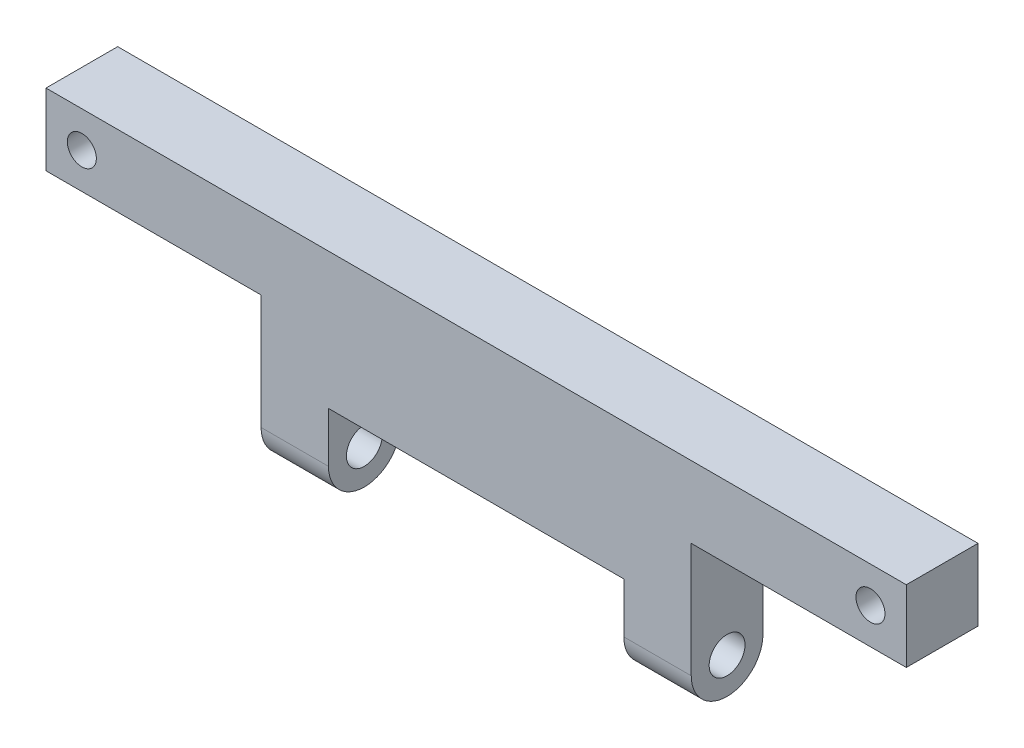
ISO-10303-21;
HEADER;
FILE_DESCRIPTION(('STEP AP214'),'2;1');
FILE_NAME('part.step','',(''),(''),'','','');
FILE_SCHEMA(('AUTOMOTIVE_DESIGN { 1 0 10303 214 1 1 1 1 }'));
ENDSEC;
DATA;
#1=APPLICATION_CONTEXT('core data for automotive mechanical design processes');
#2=APPLICATION_PROTOCOL_DEFINITION('international standard','automotive_design',2000,#1);
#3=PRODUCT_CONTEXT('',#1,'mechanical');
#4=PRODUCT('Part','Part','',(#3));
#5=PRODUCT_RELATED_PRODUCT_CATEGORY('part','',(#4));
#6=PRODUCT_DEFINITION_FORMATION('','',#4);
#7=PRODUCT_DEFINITION_CONTEXT('part definition',#1,'design');
#8=PRODUCT_DEFINITION('design','',#6,#7);
#9=PRODUCT_DEFINITION_SHAPE('','',#8);
#10=(LENGTH_UNIT() NAMED_UNIT(*) SI_UNIT(.MILLI.,.METRE.));
#11=(NAMED_UNIT(*) PLANE_ANGLE_UNIT() SI_UNIT($,.RADIAN.));
#12=(NAMED_UNIT(*) SI_UNIT($,.STERADIAN.) SOLID_ANGLE_UNIT());
#13=UNCERTAINTY_MEASURE_WITH_UNIT(LENGTH_MEASURE(1.E-05),#10,'distance_accuracy_value','');
#14=(GEOMETRIC_REPRESENTATION_CONTEXT(3) GLOBAL_UNCERTAINTY_ASSIGNED_CONTEXT((#13)) GLOBAL_UNIT_ASSIGNED_CONTEXT((#10,
#11,#12)) REPRESENTATION_CONTEXT('',''));
#15=CARTESIAN_POINT('',(0.,0.,0.));
#16=DIRECTION('',(0.,0.,1.));
#17=DIRECTION('',(1.,0.,0.));
#18=AXIS2_PLACEMENT_3D('',#15,#16,#17);
#19=CARTESIAN_POINT('',(-7.07106781186548,60.,2.5));
#20=DIRECTION('',(1.,0.,0.));
#21=DIRECTION('',(0.,0.,-1.));
#22=AXIS2_PLACEMENT_3D('',#19,#20,#21);
#23=CYLINDRICAL_SURFACE('',#22,1.25);
#24=CARTESIAN_POINT('',(0.,60.,2.5));
#25=DIRECTION('',(-1.,0.,0.));
#26=DIRECTION('',(0.,0.,1.));
#27=AXIS2_PLACEMENT_3D('',#24,#25,#26);
#28=CIRCLE('',#27,1.25);
#29=CARTESIAN_POINT('',(0.,60.,3.75));
#30=VERTEX_POINT('',#29);
#31=EDGE_CURVE('E171',#30,#30,#28,.F.);
#32=ORIENTED_EDGE('',*,*,#31,.T.);
#33=EDGE_LOOP('',(#32));
#34=FACE_BOUND('',#33,.T.);
#35=CARTESIAN_POINT('',(-4.7,60.,2.5));
#36=DIRECTION('',(1.,0.,0.));
#37=DIRECTION('',(0.,1.,0.));
#38=AXIS2_PLACEMENT_3D('',#35,#36,#37);
#39=CIRCLE('',#38,1.25);
#40=CARTESIAN_POINT('',(-4.7,61.25,2.5));
#41=VERTEX_POINT('',#40);
#42=EDGE_CURVE('E201',#41,#41,#39,.F.);
#43=ORIENTED_EDGE('',*,*,#42,.T.);
#44=EDGE_LOOP('',(#43));
#45=FACE_BOUND('',#44,.T.);
#46=ADVANCED_FACE('F33',(#34,#45),#23,.F.);
#47=CARTESIAN_POINT('',(-30.,60.,2.5));
#48=DIRECTION('',(1.,0.,0.));
#49=DIRECTION('',(0.,0.,-1.));
#50=AXIS2_PLACEMENT_3D('',#47,#48,#49);
#51=CYLINDRICAL_SURFACE('',#50,2.5);
#52=DIRECTION('',(1.,0.,0.));
#53=VECTOR('',#52,1.);
#54=CARTESIAN_POINT('',(-30.,60.,5.));
#55=LINE('',#54,#53);
#56=CARTESIAN_POINT('',(-4.7,60.,5.));
#57=VERTEX_POINT('',#56);
#58=CARTESIAN_POINT('',(0.,60.,5.));
#59=VERTEX_POINT('',#58);
#60=EDGE_CURVE('E222',#57,#59,#55,.T.);
#61=ORIENTED_EDGE('',*,*,#60,.F.);
#62=CARTESIAN_POINT('',(-4.7,60.,2.5));
#63=DIRECTION('',(1.,0.,0.));
#64=DIRECTION('',(0.,1.,0.));
#65=AXIS2_PLACEMENT_3D('',#62,#63,#64);
#66=CIRCLE('',#65,2.5);
#67=CARTESIAN_POINT('',(-4.7,60.,0.));
#68=VERTEX_POINT('',#67);
#69=EDGE_CURVE('E198',#57,#68,#66,.T.);
#70=ORIENTED_EDGE('',*,*,#69,.T.);
#71=DIRECTION('',(1.,0.,0.));
#72=VECTOR('',#71,1.);
#73=CARTESIAN_POINT('',(-30.,60.,0.));
#74=LINE('',#73,#72);
#75=CARTESIAN_POINT('',(0.,60.,0.));
#76=VERTEX_POINT('',#75);
#77=EDGE_CURVE('E214',#68,#76,#74,.T.);
#78=ORIENTED_EDGE('',*,*,#77,.T.);
#79=CARTESIAN_POINT('',(0.,60.,2.5));
#80=DIRECTION('',(-1.,0.,0.));
#81=DIRECTION('',(0.,0.,1.));
#82=AXIS2_PLACEMENT_3D('',#79,#80,#81);
#83=CIRCLE('',#82,2.5);
#84=EDGE_CURVE('E207',#76,#59,#83,.T.);
#85=ORIENTED_EDGE('',*,*,#84,.T.);
#86=EDGE_LOOP('',(#61,#70,#78,#85));
#87=FACE_BOUND('',#86,.T.);
#88=ADVANCED_FACE('F233',(#87),#51,.T.);
#89=CARTESIAN_POINT('',(-25.3,60.,2.5));
#90=DIRECTION('',(-1.,0.,0.));
#91=DIRECTION('',(0.,-1.,0.));
#92=AXIS2_PLACEMENT_3D('',#89,#90,#91);
#93=CIRCLE('',#92,1.25);
#94=CARTESIAN_POINT('',(-25.3,58.75,2.5));
#95=VERTEX_POINT('',#94);
#96=EDGE_CURVE('E189',#95,#95,#93,.F.);
#97=ORIENTED_EDGE('',*,*,#96,.T.);
#98=EDGE_LOOP('',(#97));
#99=FACE_BOUND('',#98,.T.);
#100=CARTESIAN_POINT('',(-30.,60.,2.5));
#101=DIRECTION('',(-1.,0.,0.));
#102=DIRECTION('',(0.,0.,1.));
#103=AXIS2_PLACEMENT_3D('',#100,#101,#102);
#104=CIRCLE('',#103,1.25);
#105=CARTESIAN_POINT('',(-30.,60.,3.75));
#106=VERTEX_POINT('',#105);
#107=EDGE_CURVE('E204',#106,#106,#104,.T.);
#108=ORIENTED_EDGE('',*,*,#107,.T.);
#109=EDGE_LOOP('',(#108));
#110=FACE_BOUND('',#109,.T.);
#111=ADVANCED_FACE('F35',(#99,#110),#23,.F.);
#112=CARTESIAN_POINT('',(0.,60.,2.5));
#113=DIRECTION('',(-1.,0.,0.));
#114=DIRECTION('',(0.,0.,1.));
#115=AXIS2_PLACEMENT_3D('',#112,#113,#114);
#116=PLANE('',#115);
#117=DIRECTION('',(0.,-1.,0.));
#118=VECTOR('',#117,1.);
#119=CARTESIAN_POINT('',(0.,60.,0.));
#120=LINE('',#119,#118);
#121=CARTESIAN_POINT('',(0.,68.,0.));
#122=VERTEX_POINT('',#121);
#123=EDGE_CURVE('E210',#122,#76,#120,.T.);
#124=ORIENTED_EDGE('',*,*,#123,.F.);
#125=DIRECTION('',(0.,0.,1.));
#126=VECTOR('',#125,1.);
#127=CARTESIAN_POINT('',(0.,68.,2.5));
#128=LINE('',#127,#126);
#129=CARTESIAN_POINT('',(0.,68.,5.));
#130=VERTEX_POINT('',#129);
#131=EDGE_CURVE('E56',#122,#130,#128,.T.);
#132=ORIENTED_EDGE('',*,*,#131,.T.);
#133=DIRECTION('',(0.,1.,0.));
#134=VECTOR('',#133,1.);
#135=CARTESIAN_POINT('',(0.,60.,5.));
#136=LINE('',#135,#134);
#137=EDGE_CURVE('E217',#59,#130,#136,.T.);
#138=ORIENTED_EDGE('',*,*,#137,.F.);
#139=ORIENTED_EDGE('',*,*,#84,.F.);
#140=EDGE_LOOP('',(#124,#132,#138,#139));
#141=FACE_BOUND('',#140,.T.);
#142=ORIENTED_EDGE('',*,*,#31,.F.);
#143=EDGE_LOOP('',(#142));
#144=FACE_BOUND('',#143,.T.);
#145=ADVANCED_FACE('F230',(#141,#144),#116,.F.);
#146=CARTESIAN_POINT('',(-30.,60.,2.5));
#147=DIRECTION('',(-1.,0.,0.));
#148=DIRECTION('',(0.,0.,1.));
#149=AXIS2_PLACEMENT_3D('',#146,#147,#148);
#150=PLANE('',#149);
#151=DIRECTION('',(0.,0.,1.));
#152=VECTOR('',#151,1.);
#153=CARTESIAN_POINT('',(-30.,68.,2.5));
#154=LINE('',#153,#152);
#155=CARTESIAN_POINT('',(-30.,68.,0.));
#156=VERTEX_POINT('',#155);
#157=CARTESIAN_POINT('',(-30.,68.,5.));
#158=VERTEX_POINT('',#157);
#159=EDGE_CURVE('E167',#156,#158,#154,.T.);
#160=ORIENTED_EDGE('',*,*,#159,.F.);
#161=DIRECTION('',(0.,-1.,0.));
#162=VECTOR('',#161,1.);
#163=CARTESIAN_POINT('',(-30.,60.,0.));
#164=LINE('',#163,#162);
#165=CARTESIAN_POINT('',(-30.,60.,0.));
#166=VERTEX_POINT('',#165);
#167=EDGE_CURVE('E212',#156,#166,#164,.T.);
#168=ORIENTED_EDGE('',*,*,#167,.T.);
#169=CARTESIAN_POINT('',(-30.,60.,2.5));
#170=DIRECTION('',(-1.,0.,0.));
#171=DIRECTION('',(0.,0.,1.));
#172=AXIS2_PLACEMENT_3D('',#169,#170,#171);
#173=CIRCLE('',#172,2.5);
#174=CARTESIAN_POINT('',(-30.,60.,5.));
#175=VERTEX_POINT('',#174);
#176=EDGE_CURVE('E208',#166,#175,#173,.T.);
#177=ORIENTED_EDGE('',*,*,#176,.T.);
#178=DIRECTION('',(0.,1.,0.));
#179=VECTOR('',#178,1.);
#180=CARTESIAN_POINT('',(-30.,60.,5.));
#181=LINE('',#180,#179);
#182=EDGE_CURVE('E48',#175,#158,#181,.T.);
#183=ORIENTED_EDGE('',*,*,#182,.T.);
#184=EDGE_LOOP('',(#160,#168,#177,#183));
#185=FACE_BOUND('',#184,.T.);
#186=ORIENTED_EDGE('',*,*,#107,.F.);
#187=EDGE_LOOP('',(#186));
#188=FACE_BOUND('',#187,.T.);
#189=ADVANCED_FACE('F253',(#185,#188),#150,.T.);
#190=CARTESIAN_POINT('',(-25.3,60.,0.));
#191=VERTEX_POINT('',#190);
#192=EDGE_CURVE('E220',#166,#191,#74,.T.);
#193=ORIENTED_EDGE('',*,*,#192,.T.);
#194=CARTESIAN_POINT('',(-25.3,60.,2.5));
#195=DIRECTION('',(-1.,0.,0.));
#196=DIRECTION('',(0.,-1.,0.));
#197=AXIS2_PLACEMENT_3D('',#194,#195,#196);
#198=CIRCLE('',#197,2.5);
#199=CARTESIAN_POINT('',(-25.3,60.,5.));
#200=VERTEX_POINT('',#199);
#201=EDGE_CURVE('E186',#191,#200,#198,.T.);
#202=ORIENTED_EDGE('',*,*,#201,.T.);
#203=EDGE_CURVE('E41',#175,#200,#55,.T.);
#204=ORIENTED_EDGE('',*,*,#203,.F.);
#205=ORIENTED_EDGE('',*,*,#176,.F.);
#206=EDGE_LOOP('',(#193,#202,#204,#205));
#207=FACE_BOUND('',#206,.T.);
#208=ADVANCED_FACE('F252',(#207),#51,.T.);
#209=CARTESIAN_POINT('',(-30.,60.,5.));
#210=DIRECTION('',(0.,0.,-1.));
#211=DIRECTION('',(-1.,0.,0.));
#212=AXIS2_PLACEMENT_3D('',#209,#210,#211);
#213=PLANE('',#212);
#214=CARTESIAN_POINT('',(-42.5,70.5,5.));
#215=DIRECTION('',(0.,0.,-1.));
#216=DIRECTION('',(-1.,0.,0.));
#217=AXIS2_PLACEMENT_3D('',#214,#215,#216);
#218=CIRCLE('',#217,1.01231442212876);
#219=CARTESIAN_POINT('',(-42.5,71.5123144221287,5.));
#220=VERTEX_POINT('',#219);
#221=EDGE_CURVE('E273',#220,#220,#218,.F.);
#222=ORIENTED_EDGE('',*,*,#221,.F.);
#223=EDGE_LOOP('',(#222));
#224=FACE_BOUND('',#223,.T.);
#225=CARTESIAN_POINT('',(12.5,70.5,5.));
#226=DIRECTION('',(0.,0.,-1.));
#227=DIRECTION('',(-1.,0.,0.));
#228=AXIS2_PLACEMENT_3D('',#225,#226,#227);
#229=CIRCLE('',#228,1.01231442212876);
#230=CARTESIAN_POINT('',(12.5,71.5123144221287,5.));
#231=VERTEX_POINT('',#230);
#232=EDGE_CURVE('E147',#231,#231,#229,.T.);
#233=ORIENTED_EDGE('',*,*,#232,.T.);
#234=EDGE_LOOP('',(#233));
#235=FACE_BOUND('',#234,.T.);
#236=ORIENTED_EDGE('',*,*,#137,.T.);
#237=DIRECTION('',(1.,0.,0.));
#238=VECTOR('',#237,1.);
#239=CARTESIAN_POINT('',(15.,68.,5.));
#240=LINE('',#239,#238);
#241=CARTESIAN_POINT('',(15.,68.,5.));
#242=VERTEX_POINT('',#241);
#243=EDGE_CURVE('E168',#130,#242,#240,.T.);
#244=ORIENTED_EDGE('',*,*,#243,.T.);
#245=DIRECTION('',(0.,1.,0.));
#246=VECTOR('',#245,1.);
#247=CARTESIAN_POINT('',(15.,73.,5.));
#248=LINE('',#247,#246);
#249=CARTESIAN_POINT('',(15.,73.,5.));
#250=VERTEX_POINT('',#249);
#251=EDGE_CURVE('E131',#242,#250,#248,.T.);
#252=ORIENTED_EDGE('',*,*,#251,.T.);
#253=DIRECTION('',(-1.,0.,0.));
#254=VECTOR('',#253,1.);
#255=CARTESIAN_POINT('',(15.,73.,5.));
#256=LINE('',#255,#254);
#257=CARTESIAN_POINT('',(-45.,73.,5.));
#258=VERTEX_POINT('',#257);
#259=EDGE_CURVE('E268',#250,#258,#256,.T.);
#260=ORIENTED_EDGE('',*,*,#259,.T.);
#261=DIRECTION('',(0.,-1.,0.));
#262=VECTOR('',#261,1.);
#263=CARTESIAN_POINT('',(-45.,73.,5.));
#264=LINE('',#263,#262);
#265=CARTESIAN_POINT('',(-45.,68.,5.));
#266=VERTEX_POINT('',#265);
#267=EDGE_CURVE('E159',#258,#266,#264,.T.);
#268=ORIENTED_EDGE('',*,*,#267,.T.);
#269=EDGE_CURVE('E164',#266,#158,#240,.T.);
#270=ORIENTED_EDGE('',*,*,#269,.T.);
#271=ORIENTED_EDGE('',*,*,#182,.F.);
#272=ORIENTED_EDGE('',*,*,#203,.T.);
#273=DIRECTION('',(0.,1.,0.));
#274=VECTOR('',#273,1.);
#275=CARTESIAN_POINT('',(-25.3,60.,5.));
#276=LINE('',#275,#274);
#277=CARTESIAN_POINT('',(-25.3,63.5,5.));
#278=VERTEX_POINT('',#277);
#279=EDGE_CURVE('E182',#200,#278,#276,.T.);
#280=ORIENTED_EDGE('',*,*,#279,.T.);
#281=DIRECTION('',(1.,0.,0.));
#282=VECTOR('',#281,1.);
#283=CARTESIAN_POINT('',(-30.,63.5,5.));
#284=LINE('',#283,#282);
#285=CARTESIAN_POINT('',(-4.7,63.5,5.));
#286=VERTEX_POINT('',#285);
#287=EDGE_CURVE('E192',#278,#286,#284,.T.);
#288=ORIENTED_EDGE('',*,*,#287,.T.);
#289=DIRECTION('',(0.,-1.,0.));
#290=VECTOR('',#289,1.);
#291=CARTESIAN_POINT('',(-4.7,60.,5.));
#292=LINE('',#291,#290);
#293=EDGE_CURVE('E195',#286,#57,#292,.T.);
#294=ORIENTED_EDGE('',*,*,#293,.T.);
#295=ORIENTED_EDGE('',*,*,#60,.T.);
#296=EDGE_LOOP('',(#236,#244,#252,#260,#268,#270,#271,#272,#280,#288,#294,#295));
#297=FACE_BOUND('',#296,.T.);
#298=ADVANCED_FACE('F227',(#224,#235,#297),#213,.F.);
#299=CARTESIAN_POINT('',(-30.,60.,0.));
#300=DIRECTION('',(0.,0.,1.));
#301=DIRECTION('',(0.,-1.,0.));
#302=AXIS2_PLACEMENT_3D('',#299,#300,#301);
#303=PLANE('',#302);
#304=CARTESIAN_POINT('',(-42.5,70.5,0.));
#305=DIRECTION('',(0.,0.,-1.));
#306=DIRECTION('',(0.,1.,0.));
#307=AXIS2_PLACEMENT_3D('',#304,#305,#306);
#308=CIRCLE('',#307,1.01231442212876);
#309=CARTESIAN_POINT('',(-42.5,71.5123144221287,0.));
#310=VERTEX_POINT('',#309);
#311=EDGE_CURVE('E276',#310,#310,#308,.F.);
#312=ORIENTED_EDGE('',*,*,#311,.T.);
#313=EDGE_LOOP('',(#312));
#314=FACE_BOUND('',#313,.T.);
#315=CARTESIAN_POINT('',(12.5,70.5,0.));
#316=DIRECTION('',(0.,0.,-1.));
#317=DIRECTION('',(0.,1.,0.));
#318=AXIS2_PLACEMENT_3D('',#315,#316,#317);
#319=CIRCLE('',#318,1.01231442212876);
#320=CARTESIAN_POINT('',(12.5,71.5123144221287,0.));
#321=VERTEX_POINT('',#320);
#322=EDGE_CURVE('E150',#321,#321,#319,.T.);
#323=ORIENTED_EDGE('',*,*,#322,.F.);
#324=EDGE_LOOP('',(#323));
#325=FACE_BOUND('',#324,.T.);
#326=DIRECTION('',(-1.,0.,0.));
#327=VECTOR('',#326,1.);
#328=CARTESIAN_POINT('',(15.,68.,0.));
#329=LINE('',#328,#327);
#330=CARTESIAN_POINT('',(15.,68.,0.));
#331=VERTEX_POINT('',#330);
#332=EDGE_CURVE('E138',#331,#122,#329,.T.);
#333=ORIENTED_EDGE('',*,*,#332,.T.);
#334=ORIENTED_EDGE('',*,*,#123,.T.);
#335=ORIENTED_EDGE('',*,*,#77,.F.);
#336=DIRECTION('',(0.,-1.,0.));
#337=VECTOR('',#336,1.);
#338=CARTESIAN_POINT('',(-4.7,63.5,0.));
#339=LINE('',#338,#337);
#340=CARTESIAN_POINT('',(-4.7,63.5,0.));
#341=VERTEX_POINT('',#340);
#342=EDGE_CURVE('E174',#341,#68,#339,.T.);
#343=ORIENTED_EDGE('',*,*,#342,.F.);
#344=DIRECTION('',(1.,0.,0.));
#345=VECTOR('',#344,1.);
#346=CARTESIAN_POINT('',(-4.7,63.5,0.));
#347=LINE('',#346,#345);
#348=CARTESIAN_POINT('',(-25.3,63.5,0.));
#349=VERTEX_POINT('',#348);
#350=EDGE_CURVE('E176',#349,#341,#347,.T.);
#351=ORIENTED_EDGE('',*,*,#350,.F.);
#352=DIRECTION('',(0.,-1.,0.));
#353=VECTOR('',#352,1.);
#354=CARTESIAN_POINT('',(-25.3,60.,0.));
#355=LINE('',#354,#353);
#356=EDGE_CURVE('E11',#349,#191,#355,.T.);
#357=ORIENTED_EDGE('',*,*,#356,.T.);
#358=ORIENTED_EDGE('',*,*,#192,.F.);
#359=ORIENTED_EDGE('',*,*,#167,.F.);
#360=CARTESIAN_POINT('',(-45.,68.,0.));
#361=VERTEX_POINT('',#360);
#362=EDGE_CURVE('E142',#156,#361,#329,.T.);
#363=ORIENTED_EDGE('',*,*,#362,.T.);
#364=DIRECTION('',(0.,1.,0.));
#365=VECTOR('',#364,1.);
#366=CARTESIAN_POINT('',(-45.,73.,0.));
#367=LINE('',#366,#365);
#368=CARTESIAN_POINT('',(-45.,73.,0.));
#369=VERTEX_POINT('',#368);
#370=EDGE_CURVE('E141',#361,#369,#367,.T.);
#371=ORIENTED_EDGE('',*,*,#370,.T.);
#372=DIRECTION('',(1.,0.,0.));
#373=VECTOR('',#372,1.);
#374=CARTESIAN_POINT('',(15.,73.,0.));
#375=LINE('',#374,#373);
#376=CARTESIAN_POINT('',(15.,73.,0.));
#377=VERTEX_POINT('',#376);
#378=EDGE_CURVE('E135',#369,#377,#375,.T.);
#379=ORIENTED_EDGE('',*,*,#378,.T.);
#380=DIRECTION('',(0.,-1.,0.));
#381=VECTOR('',#380,1.);
#382=CARTESIAN_POINT('',(15.,73.,0.));
#383=LINE('',#382,#381);
#384=EDGE_CURVE('E129',#377,#331,#383,.T.);
#385=ORIENTED_EDGE('',*,*,#384,.T.);
#386=EDGE_LOOP('',(#333,#334,#335,#343,#351,#357,#358,#359,#363,#371,#379,#385));
#387=FACE_BOUND('',#386,.T.);
#388=ADVANCED_FACE('F144',(#314,#325,#387),#303,.F.);
#389=CARTESIAN_POINT('',(-4.7,63.5,30.));
#390=DIRECTION('',(1.,0.,0.));
#391=DIRECTION('',(0.,1.,0.));
#392=AXIS2_PLACEMENT_3D('',#389,#390,#391);
#393=PLANE('',#392);
#394=ORIENTED_EDGE('',*,*,#293,.F.);
#395=DIRECTION('',(0.,0.,-1.));
#396=VECTOR('',#395,1.);
#397=CARTESIAN_POINT('',(-4.7,63.5,30.));
#398=LINE('',#397,#396);
#399=EDGE_CURVE('E180',#286,#341,#398,.T.);
#400=ORIENTED_EDGE('',*,*,#399,.T.);
#401=ORIENTED_EDGE('',*,*,#342,.T.);
#402=ORIENTED_EDGE('',*,*,#69,.F.);
#403=EDGE_LOOP('',(#394,#400,#401,#402));
#404=FACE_BOUND('',#403,.T.);
#405=ORIENTED_EDGE('',*,*,#42,.F.);
#406=EDGE_LOOP('',(#405));
#407=FACE_BOUND('',#406,.T.);
#408=ADVANCED_FACE('F238',(#404,#407),#393,.F.);
#409=CARTESIAN_POINT('',(-4.7,63.5,30.));
#410=DIRECTION('',(0.,1.,0.));
#411=DIRECTION('',(0.,0.,1.));
#412=AXIS2_PLACEMENT_3D('',#409,#410,#411);
#413=PLANE('',#412);
#414=DIRECTION('',(0.,0.,-1.));
#415=VECTOR('',#414,1.);
#416=CARTESIAN_POINT('',(-25.3,63.5,30.));
#417=LINE('',#416,#415);
#418=EDGE_CURVE('E179',#278,#349,#417,.T.);
#419=ORIENTED_EDGE('',*,*,#418,.T.);
#420=ORIENTED_EDGE('',*,*,#350,.T.);
#421=ORIENTED_EDGE('',*,*,#399,.F.);
#422=ORIENTED_EDGE('',*,*,#287,.F.);
#423=EDGE_LOOP('',(#419,#420,#421,#422));
#424=FACE_BOUND('',#423,.T.);
#425=ADVANCED_FACE('F242',(#424),#413,.F.);
#426=CARTESIAN_POINT('',(-25.3,63.5,30.));
#427=DIRECTION('',(-1.,0.,0.));
#428=DIRECTION('',(0.,-1.,0.));
#429=AXIS2_PLACEMENT_3D('',#426,#427,#428);
#430=PLANE('',#429);
#431=ORIENTED_EDGE('',*,*,#356,.F.);
#432=ORIENTED_EDGE('',*,*,#418,.F.);
#433=ORIENTED_EDGE('',*,*,#279,.F.);
#434=ORIENTED_EDGE('',*,*,#201,.F.);
#435=EDGE_LOOP('',(#431,#432,#433,#434));
#436=FACE_BOUND('',#435,.T.);
#437=ORIENTED_EDGE('',*,*,#96,.F.);
#438=EDGE_LOOP('',(#437));
#439=FACE_BOUND('',#438,.T.);
#440=ADVANCED_FACE('F246',(#436,#439),#430,.F.);
#441=CARTESIAN_POINT('',(15.,68.,65.2079728939615));
#442=DIRECTION('',(0.,-1.,0.));
#443=DIRECTION('',(0.,0.,-1.));
#444=AXIS2_PLACEMENT_3D('',#441,#442,#443);
#445=PLANE('',#444);
#446=ORIENTED_EDGE('',*,*,#131,.F.);
#447=ORIENTED_EDGE('',*,*,#332,.F.);
#448=DIRECTION('',(0.,0.,-1.));
#449=VECTOR('',#448,1.);
#450=CARTESIAN_POINT('',(15.,68.,65.2079728939615));
#451=LINE('',#450,#449);
#452=EDGE_CURVE('E124',#242,#331,#451,.T.);
#453=ORIENTED_EDGE('',*,*,#452,.F.);
#454=ORIENTED_EDGE('',*,*,#243,.F.);
#455=EDGE_LOOP('',(#446,#447,#453,#454));
#456=FACE_BOUND('',#455,.T.);
#457=ADVANCED_FACE('F139',(#456),#445,.T.);
#458=CARTESIAN_POINT('',(15.,73.,65.2079728939615));
#459=DIRECTION('',(1.,0.,0.));
#460=DIRECTION('',(0.,1.,0.));
#461=AXIS2_PLACEMENT_3D('',#458,#459,#460);
#462=PLANE('',#461);
#463=ORIENTED_EDGE('',*,*,#251,.F.);
#464=ORIENTED_EDGE('',*,*,#452,.T.);
#465=ORIENTED_EDGE('',*,*,#384,.F.);
#466=DIRECTION('',(0.,0.,-1.));
#467=VECTOR('',#466,1.);
#468=CARTESIAN_POINT('',(15.,73.,65.2079728939615));
#469=LINE('',#468,#467);
#470=EDGE_CURVE('E157',#250,#377,#469,.T.);
#471=ORIENTED_EDGE('',*,*,#470,.F.);
#472=EDGE_LOOP('',(#463,#464,#465,#471));
#473=FACE_BOUND('',#472,.T.);
#474=ADVANCED_FACE('F126',(#473),#462,.T.);
#475=CARTESIAN_POINT('',(15.,73.,65.2079728939615));
#476=DIRECTION('',(0.,1.,0.));
#477=DIRECTION('',(0.,0.,1.));
#478=AXIS2_PLACEMENT_3D('',#475,#476,#477);
#479=PLANE('',#478);
#480=ORIENTED_EDGE('',*,*,#259,.F.);
#481=ORIENTED_EDGE('',*,*,#470,.T.);
#482=ORIENTED_EDGE('',*,*,#378,.F.);
#483=DIRECTION('',(0.,0.,-1.));
#484=VECTOR('',#483,1.);
#485=CARTESIAN_POINT('',(-45.,73.,65.2079728939615));
#486=LINE('',#485,#484);
#487=EDGE_CURVE('E160',#258,#369,#486,.T.);
#488=ORIENTED_EDGE('',*,*,#487,.F.);
#489=EDGE_LOOP('',(#480,#481,#482,#488));
#490=FACE_BOUND('',#489,.T.);
#491=ADVANCED_FACE('F267',(#490),#479,.T.);
#492=CARTESIAN_POINT('',(-45.,73.,65.2079728939615));
#493=DIRECTION('',(-1.,0.,0.));
#494=DIRECTION('',(0.,0.,1.));
#495=AXIS2_PLACEMENT_3D('',#492,#493,#494);
#496=PLANE('',#495);
#497=ORIENTED_EDGE('',*,*,#267,.F.);
#498=ORIENTED_EDGE('',*,*,#487,.T.);
#499=ORIENTED_EDGE('',*,*,#370,.F.);
#500=DIRECTION('',(0.,0.,-1.));
#501=VECTOR('',#500,1.);
#502=CARTESIAN_POINT('',(-45.,68.,65.2079728939615));
#503=LINE('',#502,#501);
#504=EDGE_CURVE('E134',#266,#361,#503,.T.);
#505=ORIENTED_EDGE('',*,*,#504,.F.);
#506=EDGE_LOOP('',(#497,#498,#499,#505));
#507=FACE_BOUND('',#506,.T.);
#508=ADVANCED_FACE('F263',(#507),#496,.T.);
#509=ORIENTED_EDGE('',*,*,#362,.F.);
#510=ORIENTED_EDGE('',*,*,#159,.T.);
#511=ORIENTED_EDGE('',*,*,#269,.F.);
#512=ORIENTED_EDGE('',*,*,#504,.T.);
#513=EDGE_LOOP('',(#509,#510,#511,#512));
#514=FACE_BOUND('',#513,.T.);
#515=ADVANCED_FACE('F257',(#514),#445,.T.);
#516=CARTESIAN_POINT('',(12.5,70.5,41.));
#517=DIRECTION('',(0.,0.,-1.));
#518=DIRECTION('',(0.,1.,0.));
#519=AXIS2_PLACEMENT_3D('',#516,#517,#518);
#520=CYLINDRICAL_SURFACE('',#519,1.01231442212876);
#521=CARTESIAN_POINT('',(12.5,71.5123144221287,0.));
#522=CARTESIAN_POINT('',(12.5,71.5123144221287,0.0520833333333461));
#523=CARTESIAN_POINT('',(12.5,71.5123144221287,0.104166666666678));
#524=CARTESIAN_POINT('',(12.5,71.5123144221287,0.208333333333345));
#525=CARTESIAN_POINT('',(12.5,71.5123144221287,0.26041666666668));
#526=CARTESIAN_POINT('',(12.5,71.5123144221287,0.364583333333346));
#527=CARTESIAN_POINT('',(12.5,71.5123144221287,0.416666666666679));
#528=CARTESIAN_POINT('',(12.5,71.5123144221287,0.520833333333345));
#529=CARTESIAN_POINT('',(12.5,71.5123144221287,0.57291666666668));
#530=CARTESIAN_POINT('',(12.5,71.5123144221287,0.677083333333347));
#531=CARTESIAN_POINT('',(12.5,71.5123144221287,0.729166666666679));
#532=CARTESIAN_POINT('',(12.5,71.5123144221287,0.833333333333346));
#533=CARTESIAN_POINT('',(12.5,71.5123144221287,0.88541666666668));
#534=CARTESIAN_POINT('',(12.5,71.5123144221287,0.989583333333347));
#535=CARTESIAN_POINT('',(12.5,71.5123144221287,1.04166666666668));
#536=CARTESIAN_POINT('',(12.5,71.5123144221287,1.14583333333335));
#537=CARTESIAN_POINT('',(12.5,71.5123144221287,1.19791666666668));
#538=CARTESIAN_POINT('',(12.5,71.5123144221287,1.30208333333335));
#539=CARTESIAN_POINT('',(12.5,71.5123144221287,1.35416666666668));
#540=CARTESIAN_POINT('',(12.5,71.5123144221287,1.45833333333334));
#541=CARTESIAN_POINT('',(12.5,71.5123144221287,1.51041666666668));
#542=CARTESIAN_POINT('',(12.5,71.5123144221287,1.61458333333334));
#543=CARTESIAN_POINT('',(12.5,71.5123144221287,1.66666666666668));
#544=CARTESIAN_POINT('',(12.5,71.5123144221287,1.77083333333334));
#545=CARTESIAN_POINT('',(12.5,71.5123144221287,1.82291666666668));
#546=CARTESIAN_POINT('',(12.5,71.5123144221287,1.92708333333334));
#547=CARTESIAN_POINT('',(12.5,71.5123144221287,1.97916666666668));
#548=CARTESIAN_POINT('',(12.5,71.5123144221287,2.08333333333334));
#549=CARTESIAN_POINT('',(12.5,71.5123144221287,2.13541666666668));
#550=CARTESIAN_POINT('',(12.5,71.5123144221287,2.23958333333334));
#551=CARTESIAN_POINT('',(12.5,71.5123144221287,2.29166666666668));
#552=CARTESIAN_POINT('',(12.5,71.5123144221287,2.39583333333335));
#553=CARTESIAN_POINT('',(12.5,71.5123144221287,2.44791666666668));
#554=CARTESIAN_POINT('',(12.5,71.5123144221287,2.55208333333334));
#555=CARTESIAN_POINT('',(12.5,71.5123144221287,2.60416666666667));
#556=CARTESIAN_POINT('',(12.5,71.5123144221287,2.70833333333334));
#557=CARTESIAN_POINT('',(12.5,71.5123144221287,2.76041666666667));
#558=CARTESIAN_POINT('',(12.5,71.5123144221287,2.86458333333334));
#559=CARTESIAN_POINT('',(12.5,71.5123144221287,2.91666666666667));
#560=CARTESIAN_POINT('',(12.5,71.5123144221287,3.02083333333334));
#561=CARTESIAN_POINT('',(12.5,71.5123144221287,3.07291666666667));
#562=CARTESIAN_POINT('',(12.5,71.5123144221287,3.17708333333334));
#563=CARTESIAN_POINT('',(12.5,71.5123144221287,3.22916666666667));
#564=CARTESIAN_POINT('',(12.5,71.5123144221287,3.33333333333334));
#565=CARTESIAN_POINT('',(12.5,71.5123144221287,3.38541666666668));
#566=CARTESIAN_POINT('',(12.5,71.5123144221287,3.48958333333334));
#567=CARTESIAN_POINT('',(12.5,71.5123144221287,3.54166666666667));
#568=CARTESIAN_POINT('',(12.5,71.5123144221287,3.64583333333334));
#569=CARTESIAN_POINT('',(12.5,71.5123144221287,3.69791666666667));
#570=CARTESIAN_POINT('',(12.5,71.5123144221287,3.80208333333334));
#571=CARTESIAN_POINT('',(12.5,71.5123144221287,3.85416666666667));
#572=CARTESIAN_POINT('',(12.5,71.5123144221287,3.95833333333334));
#573=CARTESIAN_POINT('',(12.5,71.5123144221287,4.01041666666667));
#574=CARTESIAN_POINT('',(12.5,71.5123144221287,4.11458333333334));
#575=CARTESIAN_POINT('',(12.5,71.5123144221287,4.16666666666667));
#576=CARTESIAN_POINT('',(12.5,71.5123144221287,4.27083333333334));
#577=CARTESIAN_POINT('',(12.5,71.5123144221287,4.32291666666667));
#578=CARTESIAN_POINT('',(12.5,71.5123144221287,4.42708333333334));
#579=CARTESIAN_POINT('',(12.5,71.5123144221287,4.47916666666667));
#580=CARTESIAN_POINT('',(12.5,71.5123144221287,4.58333333333334));
#581=CARTESIAN_POINT('',(12.5,71.5123144221287,4.63541666666667));
#582=CARTESIAN_POINT('',(12.5,71.5123144221287,4.73958333333334));
#583=CARTESIAN_POINT('',(12.5,71.5123144221287,4.79166666666667));
#584=CARTESIAN_POINT('',(12.5,71.5123144221287,4.89583333333334));
#585=CARTESIAN_POINT('',(12.5,71.5123144221287,4.94791666666667));
#586=CARTESIAN_POINT('',(12.5,71.5123144221287,5.));
#587=B_SPLINE_CURVE_WITH_KNOTS('',3,(#521,#522,#523,#524,#525,#526,#527,#528,#529,#530,#531,
#532,#533,#534,#535,#536,#537,#538,#539,#540,#541,#542,#543,#544,#545,#546,#547,#548,#549,#550,
#551,#552,#553,#554,#555,#556,#557,#558,#559,#560,#561,#562,#563,#564,#565,#566,#567,#568,#569,
#570,#571,#572,#573,#574,#575,#576,#577,#578,#579,#580,#581,#582,#583,#584,#585,#586),
.UNSPECIFIED.,.F.,.F.,(4,2,2,2,2,2,2,2,2,2,2,2,2,2,2,2,2,2,2,2,2,2,2,2,2,2,2,2,2,2,2,2,4),(0.,
0.156249999999997,0.3125,0.468749999999997,0.625000000000001,0.781249999999997,
0.937500000000001,1.09375,1.25,1.40625,1.56249999999999,1.71875,1.87499999999999,2.03125,2.1875,
2.34375,2.5,2.65624999999999,2.8125,2.96874999999999,3.125,3.28124999999999,3.4375,
3.59374999999999,3.74999999999999,3.90624999999999,4.06249999999999,4.21874999999999,
4.37499999999999,4.53124999999999,4.68749999999999,4.84374999999999,4.99999999999999),.UNSPECIFIED.);
#588=EDGE_CURVE('BSEAM285',#321,#231,#587,.T.);
#589=ORIENTED_EDGE('',*,*,#322,.T.);
#590=ORIENTED_EDGE('',*,*,#232,.F.);
#591=ORIENTED_EDGE('',*,*,#588,.T.);
#592=ORIENTED_EDGE('',*,*,#588,.F.);
#593=EDGE_LOOP('',(#589,#591,#590,#592));
#594=FACE_BOUND('',#593,.T.);
#595=ADVANCED_FACE('F285',(#594),#520,.F.);
#596=CARTESIAN_POINT('',(-42.5,70.5,41.));
#597=DIRECTION('',(0.,0.,-1.));
#598=DIRECTION('',(0.,1.,0.));
#599=AXIS2_PLACEMENT_3D('',#596,#597,#598);
#600=CYLINDRICAL_SURFACE('',#599,1.01231442212876);
#601=CARTESIAN_POINT('',(-42.5,71.5123144221287,0.));
#602=CARTESIAN_POINT('',(-42.5,71.5123144221287,0.0520833333333461));
#603=CARTESIAN_POINT('',(-42.5,71.5123144221287,0.104166666666678));
#604=CARTESIAN_POINT('',(-42.5,71.5123144221287,0.208333333333345));
#605=CARTESIAN_POINT('',(-42.5,71.5123144221287,0.26041666666668));
#606=CARTESIAN_POINT('',(-42.5,71.5123144221287,0.364583333333346));
#607=CARTESIAN_POINT('',(-42.5,71.5123144221287,0.416666666666679));
#608=CARTESIAN_POINT('',(-42.5,71.5123144221287,0.520833333333345));
#609=CARTESIAN_POINT('',(-42.5,71.5123144221287,0.57291666666668));
#610=CARTESIAN_POINT('',(-42.5,71.5123144221287,0.677083333333347));
#611=CARTESIAN_POINT('',(-42.5,71.5123144221287,0.729166666666679));
#612=CARTESIAN_POINT('',(-42.5,71.5123144221287,0.833333333333346));
#613=CARTESIAN_POINT('',(-42.5,71.5123144221287,0.88541666666668));
#614=CARTESIAN_POINT('',(-42.5,71.5123144221287,0.989583333333347));
#615=CARTESIAN_POINT('',(-42.5,71.5123144221287,1.04166666666668));
#616=CARTESIAN_POINT('',(-42.5,71.5123144221287,1.14583333333335));
#617=CARTESIAN_POINT('',(-42.5,71.5123144221287,1.19791666666668));
#618=CARTESIAN_POINT('',(-42.5,71.5123144221287,1.30208333333335));
#619=CARTESIAN_POINT('',(-42.5,71.5123144221287,1.35416666666668));
#620=CARTESIAN_POINT('',(-42.5,71.5123144221287,1.45833333333334));
#621=CARTESIAN_POINT('',(-42.5,71.5123144221287,1.51041666666668));
#622=CARTESIAN_POINT('',(-42.5,71.5123144221287,1.61458333333334));
#623=CARTESIAN_POINT('',(-42.5,71.5123144221287,1.66666666666668));
#624=CARTESIAN_POINT('',(-42.5,71.5123144221287,1.77083333333334));
#625=CARTESIAN_POINT('',(-42.5,71.5123144221287,1.82291666666668));
#626=CARTESIAN_POINT('',(-42.5,71.5123144221287,1.92708333333334));
#627=CARTESIAN_POINT('',(-42.5,71.5123144221287,1.97916666666668));
#628=CARTESIAN_POINT('',(-42.5,71.5123144221287,2.08333333333334));
#629=CARTESIAN_POINT('',(-42.5,71.5123144221287,2.13541666666668));
#630=CARTESIAN_POINT('',(-42.5,71.5123144221287,2.23958333333334));
#631=CARTESIAN_POINT('',(-42.5,71.5123144221287,2.29166666666668));
#632=CARTESIAN_POINT('',(-42.5,71.5123144221287,2.39583333333335));
#633=CARTESIAN_POINT('',(-42.5,71.5123144221287,2.44791666666668));
#634=CARTESIAN_POINT('',(-42.5,71.5123144221287,2.55208333333334));
#635=CARTESIAN_POINT('',(-42.5,71.5123144221287,2.60416666666667));
#636=CARTESIAN_POINT('',(-42.5,71.5123144221287,2.70833333333334));
#637=CARTESIAN_POINT('',(-42.5,71.5123144221287,2.76041666666667));
#638=CARTESIAN_POINT('',(-42.5,71.5123144221287,2.86458333333334));
#639=CARTESIAN_POINT('',(-42.5,71.5123144221287,2.91666666666667));
#640=CARTESIAN_POINT('',(-42.5,71.5123144221287,3.02083333333334));
#641=CARTESIAN_POINT('',(-42.5,71.5123144221287,3.07291666666667));
#642=CARTESIAN_POINT('',(-42.5,71.5123144221287,3.17708333333334));
#643=CARTESIAN_POINT('',(-42.5,71.5123144221287,3.22916666666667));
#644=CARTESIAN_POINT('',(-42.5,71.5123144221287,3.33333333333334));
#645=CARTESIAN_POINT('',(-42.5,71.5123144221287,3.38541666666668));
#646=CARTESIAN_POINT('',(-42.5,71.5123144221287,3.48958333333334));
#647=CARTESIAN_POINT('',(-42.5,71.5123144221287,3.54166666666667));
#648=CARTESIAN_POINT('',(-42.5,71.5123144221287,3.64583333333334));
#649=CARTESIAN_POINT('',(-42.5,71.5123144221287,3.69791666666667));
#650=CARTESIAN_POINT('',(-42.5,71.5123144221287,3.80208333333334));
#651=CARTESIAN_POINT('',(-42.5,71.5123144221287,3.85416666666667));
#652=CARTESIAN_POINT('',(-42.5,71.5123144221287,3.95833333333334));
#653=CARTESIAN_POINT('',(-42.5,71.5123144221287,4.01041666666667));
#654=CARTESIAN_POINT('',(-42.5,71.5123144221287,4.11458333333334));
#655=CARTESIAN_POINT('',(-42.5,71.5123144221287,4.16666666666667));
#656=CARTESIAN_POINT('',(-42.5,71.5123144221287,4.27083333333334));
#657=CARTESIAN_POINT('',(-42.5,71.5123144221287,4.32291666666667));
#658=CARTESIAN_POINT('',(-42.5,71.5123144221287,4.42708333333334));
#659=CARTESIAN_POINT('',(-42.5,71.5123144221287,4.47916666666667));
#660=CARTESIAN_POINT('',(-42.5,71.5123144221287,4.58333333333334));
#661=CARTESIAN_POINT('',(-42.5,71.5123144221287,4.63541666666667));
#662=CARTESIAN_POINT('',(-42.5,71.5123144221287,4.73958333333334));
#663=CARTESIAN_POINT('',(-42.5,71.5123144221287,4.79166666666667));
#664=CARTESIAN_POINT('',(-42.5,71.5123144221287,4.89583333333334));
#665=CARTESIAN_POINT('',(-42.5,71.5123144221287,4.94791666666667));
#666=CARTESIAN_POINT('',(-42.5,71.5123144221287,5.));
#667=B_SPLINE_CURVE_WITH_KNOTS('',3,(#601,#602,#603,#604,#605,#606,#607,#608,#609,#610,#611,
#612,#613,#614,#615,#616,#617,#618,#619,#620,#621,#622,#623,#624,#625,#626,#627,#628,#629,#630,
#631,#632,#633,#634,#635,#636,#637,#638,#639,#640,#641,#642,#643,#644,#645,#646,#647,#648,#649,
#650,#651,#652,#653,#654,#655,#656,#657,#658,#659,#660,#661,#662,#663,#664,#665,#666),
.UNSPECIFIED.,.F.,.F.,(4,2,2,2,2,2,2,2,2,2,2,2,2,2,2,2,2,2,2,2,2,2,2,2,2,2,2,2,2,2,2,2,4),(0.,
0.156249999999997,0.3125,0.468749999999997,0.625000000000001,0.781249999999997,
0.937500000000001,1.09375,1.25,1.40625,1.56249999999999,1.71875,1.87499999999999,2.03125,2.1875,
2.34375,2.5,2.65624999999999,2.8125,2.96874999999999,3.125,3.28124999999999,3.4375,
3.59374999999999,3.74999999999999,3.90624999999999,4.06249999999999,4.21874999999999,
4.37499999999999,4.53124999999999,4.68749999999999,4.84374999999999,4.99999999999999),.UNSPECIFIED.);
#668=EDGE_CURVE('BSEAM282',#310,#220,#667,.T.);
#669=ORIENTED_EDGE('',*,*,#311,.F.);
#670=ORIENTED_EDGE('',*,*,#221,.T.);
#671=ORIENTED_EDGE('',*,*,#668,.T.);
#672=ORIENTED_EDGE('',*,*,#668,.F.);
#673=EDGE_LOOP('',(#669,#671,#670,#672));
#674=FACE_BOUND('',#673,.T.);
#675=ADVANCED_FACE('F282',(#674),#600,.F.);
#676=CLOSED_SHELL('',(#46,#88,#111,#145,#189,#208,#298,#388,#408,#425,#440,#457,#474,#491,#508,
#515,#595,#675));
#677=MANIFOLD_SOLID_BREP('B2',#676);
#678=ADVANCED_BREP_SHAPE_REPRESENTATION('',(#18,#677),#14);
#679=SHAPE_DEFINITION_REPRESENTATION(#9,#678);
ENDSEC;
END-ISO-10303-21;
